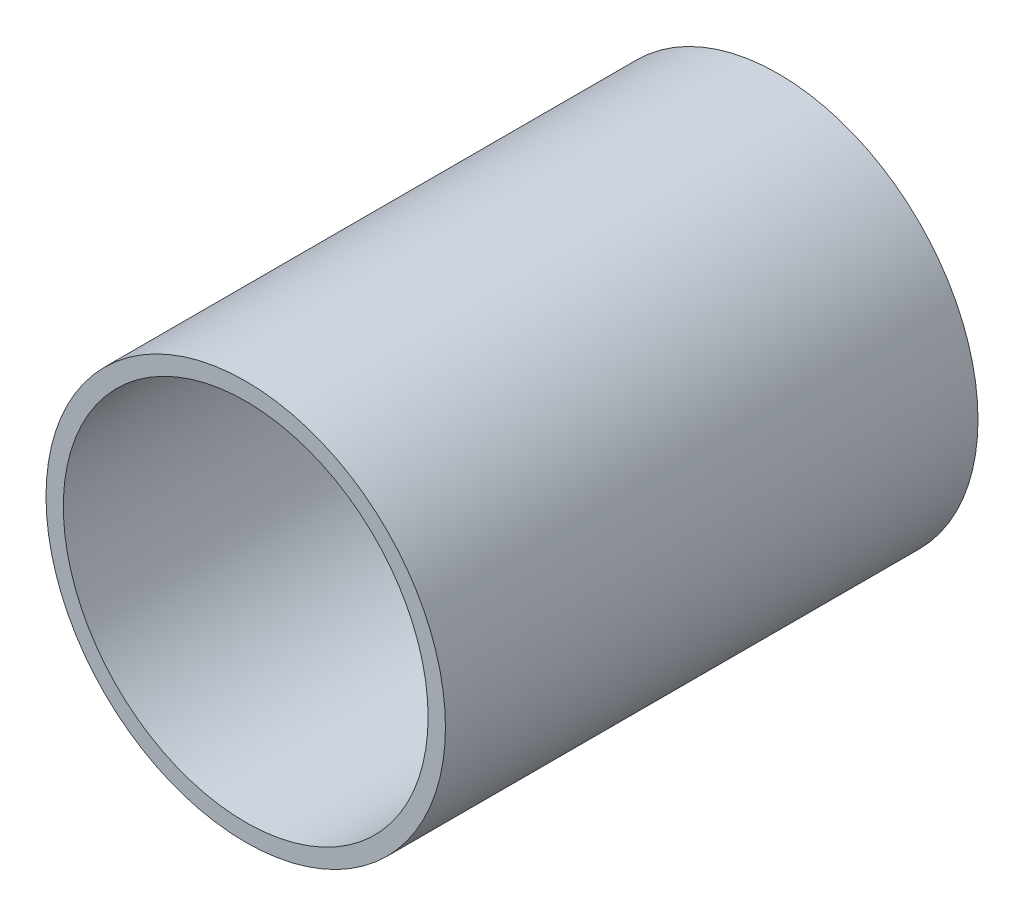
ISO-10303-21;
HEADER;
FILE_DESCRIPTION(('STEP AP214'),'2;1');
FILE_NAME('part.step','',(''),(''),'','','');
FILE_SCHEMA(('AUTOMOTIVE_DESIGN { 1 0 10303 214 1 1 1 1 }'));
ENDSEC;
DATA;
#1=APPLICATION_CONTEXT('core data for automotive mechanical design processes');
#2=APPLICATION_PROTOCOL_DEFINITION('international standard','automotive_design',2000,#1);
#3=PRODUCT_CONTEXT('',#1,'mechanical');
#4=PRODUCT('Part','Part','',(#3));
#5=PRODUCT_RELATED_PRODUCT_CATEGORY('part','',(#4));
#6=PRODUCT_DEFINITION_FORMATION('','',#4);
#7=PRODUCT_DEFINITION_CONTEXT('part definition',#1,'design');
#8=PRODUCT_DEFINITION('design','',#6,#7);
#9=PRODUCT_DEFINITION_SHAPE('','',#8);
#10=(LENGTH_UNIT() NAMED_UNIT(*) SI_UNIT(.MILLI.,.METRE.));
#11=(NAMED_UNIT(*) PLANE_ANGLE_UNIT() SI_UNIT($,.RADIAN.));
#12=(NAMED_UNIT(*) SI_UNIT($,.STERADIAN.) SOLID_ANGLE_UNIT());
#13=UNCERTAINTY_MEASURE_WITH_UNIT(LENGTH_MEASURE(1.E-05),#10,'distance_accuracy_value','');
#14=(GEOMETRIC_REPRESENTATION_CONTEXT(3) GLOBAL_UNCERTAINTY_ASSIGNED_CONTEXT((#13)) GLOBAL_UNIT_ASSIGNED_CONTEXT((#10,
#11,#12)) REPRESENTATION_CONTEXT('',''));
#15=CARTESIAN_POINT('',(0.,0.,0.));
#16=DIRECTION('',(0.,0.,1.));
#17=DIRECTION('',(1.,0.,0.));
#18=AXIS2_PLACEMENT_3D('',#15,#16,#17);
#19=CARTESIAN_POINT('',(0.,0.,50.8));
#20=DIRECTION('',(0.,0.,1.));
#21=DIRECTION('',(1.,0.,0.));
#22=AXIS2_PLACEMENT_3D('',#19,#20,#21);
#23=PLANE('',#22);
#24=CARTESIAN_POINT('',(0.,0.,50.8));
#25=DIRECTION('',(0.,0.,1.));
#26=DIRECTION('',(1.,0.,0.));
#27=AXIS2_PLACEMENT_3D('',#24,#25,#26);
#28=CIRCLE('',#27,19.05);
#29=CARTESIAN_POINT('',(19.05,0.,50.8));
#30=VERTEX_POINT('',#29);
#31=EDGE_CURVE('E10',#30,#30,#28,.T.);
#32=ORIENTED_EDGE('',*,*,#31,.T.);
#33=EDGE_LOOP('',(#32));
#34=FACE_BOUND('',#33,.T.);
#35=CARTESIAN_POINT('',(0.,0.,50.8));
#36=DIRECTION('',(0.,0.,1.));
#37=DIRECTION('',(1.,0.,0.));
#38=AXIS2_PLACEMENT_3D('',#35,#36,#37);
#39=CIRCLE('',#38,17.399);
#40=CARTESIAN_POINT('',(17.399,0.,50.8));
#41=VERTEX_POINT('',#40);
#42=EDGE_CURVE('E43',#41,#41,#39,.T.);
#43=ORIENTED_EDGE('',*,*,#42,.F.);
#44=EDGE_LOOP('',(#43));
#45=FACE_BOUND('',#44,.T.);
#46=ADVANCED_FACE('F32',(#34,#45),#23,.T.);
#47=CARTESIAN_POINT('',(0.,0.,0.));
#48=DIRECTION('',(0.,0.,1.));
#49=DIRECTION('',(1.,0.,0.));
#50=AXIS2_PLACEMENT_3D('',#47,#48,#49);
#51=PLANE('',#50);
#52=CARTESIAN_POINT('',(0.,0.,0.));
#53=DIRECTION('',(0.,0.,1.));
#54=DIRECTION('',(1.,0.,0.));
#55=AXIS2_PLACEMENT_3D('',#52,#53,#54);
#56=CIRCLE('',#55,19.05);
#57=CARTESIAN_POINT('',(19.05,0.,0.));
#58=VERTEX_POINT('',#57);
#59=EDGE_CURVE('E36',#58,#58,#56,.T.);
#60=ORIENTED_EDGE('',*,*,#59,.F.);
#61=EDGE_LOOP('',(#60));
#62=FACE_BOUND('',#61,.T.);
#63=CARTESIAN_POINT('',(0.,0.,0.));
#64=DIRECTION('',(0.,0.,1.));
#65=DIRECTION('',(1.,0.,0.));
#66=AXIS2_PLACEMENT_3D('',#63,#64,#65);
#67=CIRCLE('',#66,17.399);
#68=CARTESIAN_POINT('',(17.399,0.,0.));
#69=VERTEX_POINT('',#68);
#70=EDGE_CURVE('E45',#69,#69,#67,.T.);
#71=ORIENTED_EDGE('',*,*,#70,.T.);
#72=EDGE_LOOP('',(#71));
#73=FACE_BOUND('',#72,.T.);
#74=ADVANCED_FACE('F55',(#62,#73),#51,.F.);
#75=CARTESIAN_POINT('',(0.,0.,50.8));
#76=DIRECTION('',(0.,0.,-1.));
#77=DIRECTION('',(-1.,0.,0.));
#78=AXIS2_PLACEMENT_3D('',#75,#76,#77);
#79=CYLINDRICAL_SURFACE('',#78,19.05);
#80=ORIENTED_EDGE('',*,*,#31,.F.);
#81=EDGE_LOOP('',(#80));
#82=FACE_BOUND('',#81,.T.);
#83=ORIENTED_EDGE('',*,*,#59,.T.);
#84=EDGE_LOOP('',(#83));
#85=FACE_BOUND('',#84,.T.);
#86=ADVANCED_FACE('F34',(#82,#85),#79,.T.);
#87=CARTESIAN_POINT('',(0.,0.,50.8));
#88=DIRECTION('',(0.,0.,-1.));
#89=DIRECTION('',(-1.,0.,0.));
#90=AXIS2_PLACEMENT_3D('',#87,#88,#89);
#91=CYLINDRICAL_SURFACE('',#90,17.399);
#92=ORIENTED_EDGE('',*,*,#42,.T.);
#93=EDGE_LOOP('',(#92));
#94=FACE_BOUND('',#93,.T.);
#95=ORIENTED_EDGE('',*,*,#70,.F.);
#96=EDGE_LOOP('',(#95));
#97=FACE_BOUND('',#96,.T.);
#98=ADVANCED_FACE('F51',(#94,#97),#91,.F.);
#99=CLOSED_SHELL('',(#46,#74,#86,#98));
#100=MANIFOLD_SOLID_BREP('B2',#99);
#101=ADVANCED_BREP_SHAPE_REPRESENTATION('',(#18,#100),#14);
#102=SHAPE_DEFINITION_REPRESENTATION(#9,#101);
ENDSEC;
END-ISO-10303-21;
